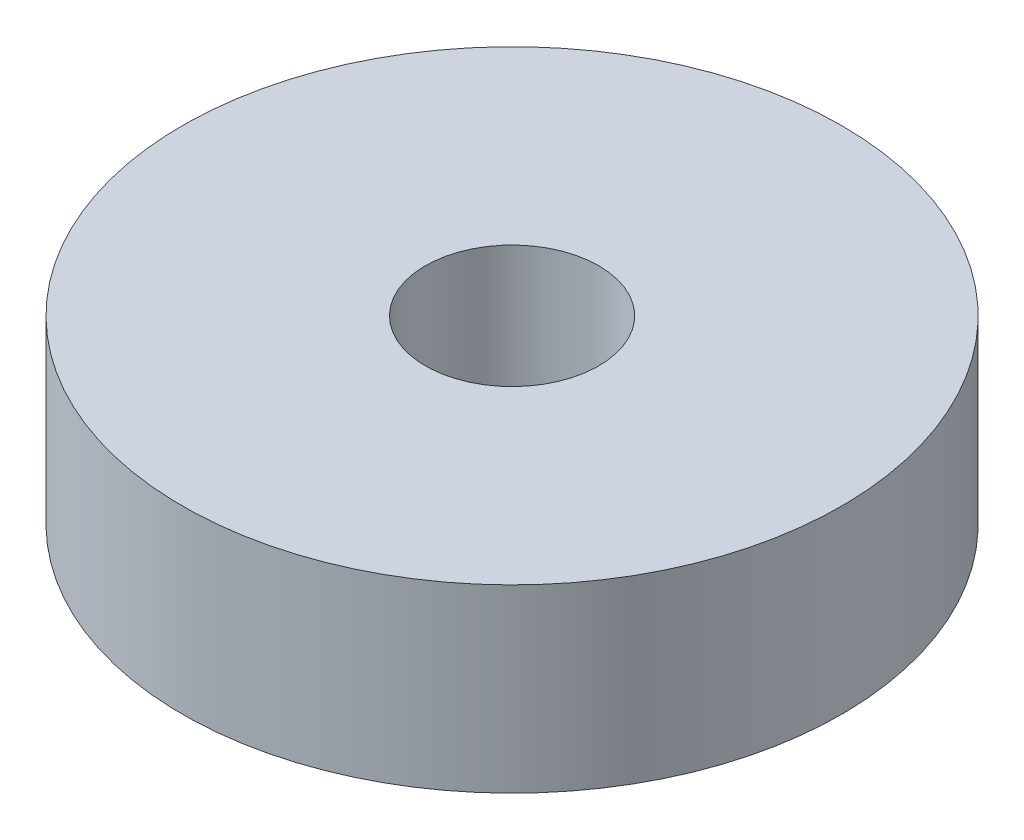
ISO-10303-21;
HEADER;
FILE_DESCRIPTION(('STEP AP214'),'2;1');
FILE_NAME('part.step','',(''),(''),'','','');
FILE_SCHEMA(('AUTOMOTIVE_DESIGN { 1 0 10303 214 1 1 1 1 }'));
ENDSEC;
DATA;
#1=APPLICATION_CONTEXT('core data for automotive mechanical design processes');
#2=APPLICATION_PROTOCOL_DEFINITION('international standard','automotive_design',2000,#1);
#3=PRODUCT_CONTEXT('',#1,'mechanical');
#4=PRODUCT('Part','Part','',(#3));
#5=PRODUCT_RELATED_PRODUCT_CATEGORY('part','',(#4));
#6=PRODUCT_DEFINITION_FORMATION('','',#4);
#7=PRODUCT_DEFINITION_CONTEXT('part definition',#1,'design');
#8=PRODUCT_DEFINITION('design','',#6,#7);
#9=PRODUCT_DEFINITION_SHAPE('','',#8);
#10=(LENGTH_UNIT() NAMED_UNIT(*) SI_UNIT(.MILLI.,.METRE.));
#11=(NAMED_UNIT(*) PLANE_ANGLE_UNIT() SI_UNIT($,.RADIAN.));
#12=(NAMED_UNIT(*) SI_UNIT($,.STERADIAN.) SOLID_ANGLE_UNIT());
#13=UNCERTAINTY_MEASURE_WITH_UNIT(LENGTH_MEASURE(1.E-05),#10,'distance_accuracy_value','');
#14=(GEOMETRIC_REPRESENTATION_CONTEXT(3) GLOBAL_UNCERTAINTY_ASSIGNED_CONTEXT((#13)) GLOBAL_UNIT_ASSIGNED_CONTEXT((#10,
#11,#12)) REPRESENTATION_CONTEXT('',''));
#15=CARTESIAN_POINT('',(0.,0.,0.));
#16=DIRECTION('',(0.,0.,1.));
#17=DIRECTION('',(1.,0.,0.));
#18=AXIS2_PLACEMENT_3D('',#15,#16,#17);
#19=CARTESIAN_POINT('',(0.,26.,0.));
#20=DIRECTION('',(0.,-1.,0.));
#21=DIRECTION('',(0.,0.,-1.));
#22=AXIS2_PLACEMENT_3D('',#19,#20,#21);
#23=CYLINDRICAL_SURFACE('',#22,47.5);
#24=CARTESIAN_POINT('',(0.,26.,0.));
#25=DIRECTION('',(0.,1.,0.));
#26=DIRECTION('',(0.,0.,1.));
#27=AXIS2_PLACEMENT_3D('',#24,#25,#26);
#28=CIRCLE('',#27,47.5);
#29=CARTESIAN_POINT('',(0.,26.,-47.5));
#30=VERTEX_POINT('',#29);
#31=EDGE_CURVE('E10',#30,#30,#28,.T.);
#32=CARTESIAN_POINT('',(0.,0.,0.));
#33=DIRECTION('',(0.,1.,0.));
#34=DIRECTION('',(0.,0.,1.));
#35=AXIS2_PLACEMENT_3D('',#32,#33,#34);
#36=CIRCLE('',#35,47.5);
#37=CARTESIAN_POINT('',(0.,0.,-47.5));
#38=VERTEX_POINT('',#37);
#39=EDGE_CURVE('E37',#38,#38,#36,.T.);
#40=CARTESIAN_POINT('',(0.,26.,-47.5));
#41=CARTESIAN_POINT('',(0.,25.7291666666667,-47.5));
#42=CARTESIAN_POINT('',(0.,25.4583333333333,-47.5));
#43=CARTESIAN_POINT('',(0.,24.9166666666667,-47.5));
#44=CARTESIAN_POINT('',(0.,24.6458333333333,-47.5));
#45=CARTESIAN_POINT('',(0.,24.1041666666667,-47.5));
#46=CARTESIAN_POINT('',(0.,23.8333333333333,-47.5));
#47=CARTESIAN_POINT('',(0.,23.2916666666667,-47.5));
#48=CARTESIAN_POINT('',(0.,23.0208333333333,-47.5));
#49=CARTESIAN_POINT('',(0.,22.4791666666667,-47.5));
#50=CARTESIAN_POINT('',(0.,22.2083333333333,-47.5));
#51=CARTESIAN_POINT('',(0.,21.6666666666667,-47.5));
#52=CARTESIAN_POINT('',(0.,21.3958333333333,-47.5));
#53=CARTESIAN_POINT('',(0.,20.8541666666667,-47.5));
#54=CARTESIAN_POINT('',(0.,20.5833333333333,-47.5));
#55=CARTESIAN_POINT('',(0.,20.0416666666667,-47.5));
#56=CARTESIAN_POINT('',(0.,19.7708333333333,-47.5));
#57=CARTESIAN_POINT('',(0.,19.2291666666667,-47.5));
#58=CARTESIAN_POINT('',(0.,18.9583333333333,-47.5));
#59=CARTESIAN_POINT('',(0.,18.4166666666667,-47.5));
#60=CARTESIAN_POINT('',(0.,18.1458333333333,-47.5));
#61=CARTESIAN_POINT('',(0.,17.6041666666667,-47.5));
#62=CARTESIAN_POINT('',(0.,17.3333333333333,-47.5));
#63=CARTESIAN_POINT('',(0.,16.7916666666667,-47.5));
#64=CARTESIAN_POINT('',(0.,16.5208333333333,-47.5));
#65=CARTESIAN_POINT('',(0.,15.9791666666667,-47.5));
#66=CARTESIAN_POINT('',(0.,15.7083333333333,-47.5));
#67=CARTESIAN_POINT('',(0.,15.1666666666667,-47.5));
#68=CARTESIAN_POINT('',(0.,14.8958333333333,-47.5));
#69=CARTESIAN_POINT('',(0.,14.3541666666667,-47.5));
#70=CARTESIAN_POINT('',(0.,14.0833333333333,-47.5));
#71=CARTESIAN_POINT('',(0.,13.5416666666667,-47.5));
#72=CARTESIAN_POINT('',(0.,13.2708333333333,-47.5));
#73=CARTESIAN_POINT('',(0.,12.7291666666667,-47.5));
#74=CARTESIAN_POINT('',(0.,12.4583333333333,-47.5));
#75=CARTESIAN_POINT('',(0.,11.9166666666667,-47.5));
#76=CARTESIAN_POINT('',(0.,11.6458333333333,-47.5));
#77=CARTESIAN_POINT('',(0.,11.1041666666667,-47.5));
#78=CARTESIAN_POINT('',(0.,10.8333333333333,-47.5));
#79=CARTESIAN_POINT('',(0.,10.2916666666667,-47.5));
#80=CARTESIAN_POINT('',(0.,10.0208333333333,-47.5));
#81=CARTESIAN_POINT('',(0.,9.47916666666667,-47.5));
#82=CARTESIAN_POINT('',(0.,9.20833333333333,-47.5));
#83=CARTESIAN_POINT('',(0.,8.66666666666667,-47.5));
#84=CARTESIAN_POINT('',(0.,8.39583333333333,-47.5));
#85=CARTESIAN_POINT('',(0.,7.85416666666667,-47.5));
#86=CARTESIAN_POINT('',(0.,7.58333333333333,-47.5));
#87=CARTESIAN_POINT('',(0.,7.04166666666667,-47.5));
#88=CARTESIAN_POINT('',(0.,6.77083333333333,-47.5));
#89=CARTESIAN_POINT('',(0.,6.22916666666667,-47.5));
#90=CARTESIAN_POINT('',(0.,5.95833333333333,-47.5));
#91=CARTESIAN_POINT('',(0.,5.41666666666667,-47.5));
#92=CARTESIAN_POINT('',(0.,5.14583333333333,-47.5));
#93=CARTESIAN_POINT('',(0.,4.60416666666667,-47.5));
#94=CARTESIAN_POINT('',(0.,4.33333333333333,-47.5));
#95=CARTESIAN_POINT('',(0.,3.79166666666667,-47.5));
#96=CARTESIAN_POINT('',(0.,3.52083333333333,-47.5));
#97=CARTESIAN_POINT('',(0.,2.97916666666667,-47.5));
#98=CARTESIAN_POINT('',(0.,2.70833333333333,-47.5));
#99=CARTESIAN_POINT('',(0.,2.16666666666667,-47.5));
#100=CARTESIAN_POINT('',(0.,1.89583333333333,-47.5));
#101=CARTESIAN_POINT('',(0.,1.35416666666667,-47.5));
#102=CARTESIAN_POINT('',(0.,1.08333333333333,-47.5));
#103=CARTESIAN_POINT('',(0.,0.541666666666667,-47.5));
#104=CARTESIAN_POINT('',(0.,0.270833333333334,-47.5));
#105=CARTESIAN_POINT('',(0.,0.,-47.5));
#106=B_SPLINE_CURVE_WITH_KNOTS('',3,(#40,#41,#42,#43,#44,#45,#46,#47,#48,#49,#50,#51,#52,#53,
#54,#55,#56,#57,#58,#59,#60,#61,#62,#63,#64,#65,#66,#67,#68,#69,#70,#71,#72,#73,#74,#75,#76,#77,
#78,#79,#80,#81,#82,#83,#84,#85,#86,#87,#88,#89,#90,#91,#92,#93,#94,#95,#96,#97,#98,#99,#100,
#101,#102,#103,#104,#105),.UNSPECIFIED.,.F.,.F.,(4,2,2,2,2,2,2,2,2,2,2,2,2,2,2,2,2,2,2,2,2,2,2,
2,2,2,2,2,2,2,2,2,4),(0.,0.812500000000001,1.625,2.4375,3.25,4.0625,4.875,5.6875,6.5,7.3125,
8.125,8.9375,9.75,10.5625,11.375,12.1875,13.,13.8125,14.625,15.4375,16.25,17.0625,17.875,
18.6875,19.5,20.3125,21.125,21.9375,22.75,23.5625,24.375,25.1875,26.),.UNSPECIFIED.);
#107=EDGE_CURVE('BSEAM40',#30,#38,#106,.T.);
#108=ORIENTED_EDGE('',*,*,#31,.F.);
#109=ORIENTED_EDGE('',*,*,#39,.T.);
#110=ORIENTED_EDGE('',*,*,#107,.T.);
#111=ORIENTED_EDGE('',*,*,#107,.F.);
#112=EDGE_LOOP('',(#108,#110,#109,#111));
#113=FACE_BOUND('',#112,.T.);
#114=ADVANCED_FACE('F40',(#113),#23,.T.);
#115=CARTESIAN_POINT('',(0.,26.,0.));
#116=DIRECTION('',(0.,1.,0.));
#117=DIRECTION('',(0.,0.,1.));
#118=AXIS2_PLACEMENT_3D('',#115,#116,#117);
#119=PLANE('',#118);
#120=CARTESIAN_POINT('',(0.,26.,0.));
#121=DIRECTION('',(0.,1.,0.));
#122=DIRECTION('',(0.,0.,1.));
#123=AXIS2_PLACEMENT_3D('',#120,#121,#122);
#124=CIRCLE('',#123,12.5);
#125=CARTESIAN_POINT('',(0.,26.,-12.5));
#126=VERTEX_POINT('',#125);
#127=EDGE_CURVE('E50',#126,#126,#124,.T.);
#128=ORIENTED_EDGE('',*,*,#127,.F.);
#129=EDGE_LOOP('',(#128));
#130=FACE_BOUND('',#129,.T.);
#131=ORIENTED_EDGE('',*,*,#31,.T.);
#132=EDGE_LOOP('',(#131));
#133=FACE_BOUND('',#132,.T.);
#134=ADVANCED_FACE('F59',(#130,#133),#119,.T.);
#135=CARTESIAN_POINT('',(0.,0.,0.));
#136=DIRECTION('',(0.,1.,0.));
#137=DIRECTION('',(0.,0.,1.));
#138=AXIS2_PLACEMENT_3D('',#135,#136,#137);
#139=PLANE('',#138);
#140=CARTESIAN_POINT('',(0.,0.,0.));
#141=DIRECTION('',(0.,1.,0.));
#142=DIRECTION('',(0.,0.,1.));
#143=AXIS2_PLACEMENT_3D('',#140,#141,#142);
#144=CIRCLE('',#143,12.5);
#145=CARTESIAN_POINT('',(0.,0.,-12.5));
#146=VERTEX_POINT('',#145);
#147=EDGE_CURVE('E47',#146,#146,#144,.T.);
#148=ORIENTED_EDGE('',*,*,#147,.T.);
#149=EDGE_LOOP('',(#148));
#150=FACE_BOUND('',#149,.T.);
#151=ORIENTED_EDGE('',*,*,#39,.F.);
#152=EDGE_LOOP('',(#151));
#153=FACE_BOUND('',#152,.T.);
#154=ADVANCED_FACE('F58',(#150,#153),#139,.F.);
#155=CARTESIAN_POINT('',(0.,26.,0.));
#156=DIRECTION('',(0.,-1.,0.));
#157=DIRECTION('',(0.,0.,-1.));
#158=AXIS2_PLACEMENT_3D('',#155,#156,#157);
#159=CYLINDRICAL_SURFACE('',#158,12.5);
#160=CARTESIAN_POINT('',(0.,26.,-12.5));
#161=CARTESIAN_POINT('',(0.,25.7291666666667,-12.5));
#162=CARTESIAN_POINT('',(0.,25.4583333333333,-12.5));
#163=CARTESIAN_POINT('',(0.,24.9166666666667,-12.5));
#164=CARTESIAN_POINT('',(0.,24.6458333333333,-12.5));
#165=CARTESIAN_POINT('',(0.,24.1041666666667,-12.5));
#166=CARTESIAN_POINT('',(0.,23.8333333333333,-12.5));
#167=CARTESIAN_POINT('',(0.,23.2916666666667,-12.5));
#168=CARTESIAN_POINT('',(0.,23.0208333333333,-12.5));
#169=CARTESIAN_POINT('',(0.,22.4791666666667,-12.5));
#170=CARTESIAN_POINT('',(0.,22.2083333333333,-12.5));
#171=CARTESIAN_POINT('',(0.,21.6666666666667,-12.5));
#172=CARTESIAN_POINT('',(0.,21.3958333333333,-12.5));
#173=CARTESIAN_POINT('',(0.,20.8541666666667,-12.5));
#174=CARTESIAN_POINT('',(0.,20.5833333333333,-12.5));
#175=CARTESIAN_POINT('',(0.,20.0416666666667,-12.5));
#176=CARTESIAN_POINT('',(0.,19.7708333333333,-12.5));
#177=CARTESIAN_POINT('',(0.,19.2291666666667,-12.5));
#178=CARTESIAN_POINT('',(0.,18.9583333333333,-12.5));
#179=CARTESIAN_POINT('',(0.,18.4166666666667,-12.5));
#180=CARTESIAN_POINT('',(0.,18.1458333333333,-12.5));
#181=CARTESIAN_POINT('',(0.,17.6041666666667,-12.5));
#182=CARTESIAN_POINT('',(0.,17.3333333333333,-12.5));
#183=CARTESIAN_POINT('',(0.,16.7916666666667,-12.5));
#184=CARTESIAN_POINT('',(0.,16.5208333333333,-12.5));
#185=CARTESIAN_POINT('',(0.,15.9791666666667,-12.5));
#186=CARTESIAN_POINT('',(0.,15.7083333333333,-12.5));
#187=CARTESIAN_POINT('',(0.,15.1666666666667,-12.5));
#188=CARTESIAN_POINT('',(0.,14.8958333333333,-12.5));
#189=CARTESIAN_POINT('',(0.,14.3541666666667,-12.5));
#190=CARTESIAN_POINT('',(0.,14.0833333333333,-12.5));
#191=CARTESIAN_POINT('',(0.,13.5416666666667,-12.5));
#192=CARTESIAN_POINT('',(0.,13.2708333333333,-12.5));
#193=CARTESIAN_POINT('',(0.,12.7291666666667,-12.5));
#194=CARTESIAN_POINT('',(0.,12.4583333333333,-12.5));
#195=CARTESIAN_POINT('',(0.,11.9166666666667,-12.5));
#196=CARTESIAN_POINT('',(0.,11.6458333333333,-12.5));
#197=CARTESIAN_POINT('',(0.,11.1041666666667,-12.5));
#198=CARTESIAN_POINT('',(0.,10.8333333333333,-12.5));
#199=CARTESIAN_POINT('',(0.,10.2916666666667,-12.5));
#200=CARTESIAN_POINT('',(0.,10.0208333333333,-12.5));
#201=CARTESIAN_POINT('',(0.,9.47916666666667,-12.5));
#202=CARTESIAN_POINT('',(0.,9.20833333333333,-12.5));
#203=CARTESIAN_POINT('',(0.,8.66666666666667,-12.5));
#204=CARTESIAN_POINT('',(0.,8.39583333333333,-12.5));
#205=CARTESIAN_POINT('',(0.,7.85416666666667,-12.5));
#206=CARTESIAN_POINT('',(0.,7.58333333333333,-12.5));
#207=CARTESIAN_POINT('',(0.,7.04166666666667,-12.5));
#208=CARTESIAN_POINT('',(0.,6.77083333333333,-12.5));
#209=CARTESIAN_POINT('',(0.,6.22916666666667,-12.5));
#210=CARTESIAN_POINT('',(0.,5.95833333333333,-12.5));
#211=CARTESIAN_POINT('',(0.,5.41666666666667,-12.5));
#212=CARTESIAN_POINT('',(0.,5.14583333333333,-12.5));
#213=CARTESIAN_POINT('',(0.,4.60416666666667,-12.5));
#214=CARTESIAN_POINT('',(0.,4.33333333333333,-12.5));
#215=CARTESIAN_POINT('',(0.,3.79166666666667,-12.5));
#216=CARTESIAN_POINT('',(0.,3.52083333333333,-12.5));
#217=CARTESIAN_POINT('',(0.,2.97916666666667,-12.5));
#218=CARTESIAN_POINT('',(0.,2.70833333333333,-12.5));
#219=CARTESIAN_POINT('',(0.,2.16666666666667,-12.5));
#220=CARTESIAN_POINT('',(0.,1.89583333333333,-12.5));
#221=CARTESIAN_POINT('',(0.,1.35416666666667,-12.5));
#222=CARTESIAN_POINT('',(0.,1.08333333333333,-12.5));
#223=CARTESIAN_POINT('',(0.,0.541666666666667,-12.5));
#224=CARTESIAN_POINT('',(0.,0.270833333333334,-12.5));
#225=CARTESIAN_POINT('',(0.,0.,-12.5));
#226=B_SPLINE_CURVE_WITH_KNOTS('',3,(#160,#161,#162,#163,#164,#165,#166,#167,#168,#169,#170,
#171,#172,#173,#174,#175,#176,#177,#178,#179,#180,#181,#182,#183,#184,#185,#186,#187,#188,#189,
#190,#191,#192,#193,#194,#195,#196,#197,#198,#199,#200,#201,#202,#203,#204,#205,#206,#207,#208,
#209,#210,#211,#212,#213,#214,#215,#216,#217,#218,#219,#220,#221,#222,#223,#224,#225),
.UNSPECIFIED.,.F.,.F.,(4,2,2,2,2,2,2,2,2,2,2,2,2,2,2,2,2,2,2,2,2,2,2,2,2,2,2,2,2,2,2,2,4),(0.,
0.812499999999997,1.625,2.4375,3.25,4.0625,4.875,5.6875,6.5,7.3125,8.125,8.93749999999999,
9.74999999999999,10.5625,11.375,12.1875,13.,13.8125,14.625,15.4375,16.25,17.0625,17.875,18.6875,
19.5,20.3125,21.125,21.9375,22.75,23.5625,24.375,25.1875,26.),.UNSPECIFIED.);
#227=EDGE_CURVE('BSEAM54',#126,#146,#226,.T.);
#228=ORIENTED_EDGE('',*,*,#127,.T.);
#229=ORIENTED_EDGE('',*,*,#147,.F.);
#230=ORIENTED_EDGE('',*,*,#227,.T.);
#231=ORIENTED_EDGE('',*,*,#227,.F.);
#232=EDGE_LOOP('',(#228,#230,#229,#231));
#233=FACE_BOUND('',#232,.T.);
#234=ADVANCED_FACE('F54',(#233),#159,.F.);
#235=CLOSED_SHELL('',(#114,#134,#154,#234));
#236=MANIFOLD_SOLID_BREP('B2',#235);
#237=ADVANCED_BREP_SHAPE_REPRESENTATION('',(#18,#236),#14);
#238=SHAPE_DEFINITION_REPRESENTATION(#9,#237);
ENDSEC;
END-ISO-10303-21;
